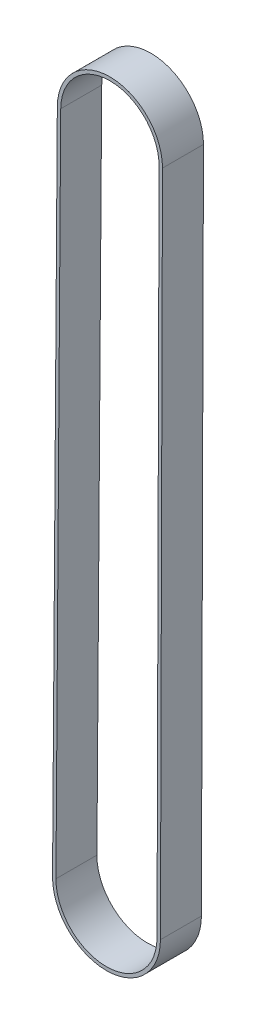
ISO-10303-21;
HEADER;
FILE_DESCRIPTION(('STEP AP214'),'2;1');
FILE_NAME('part.step','',(''),(''),'','','');
FILE_SCHEMA(('AUTOMOTIVE_DESIGN { 1 0 10303 214 1 1 1 1 }'));
ENDSEC;
DATA;
#1=APPLICATION_CONTEXT('core data for automotive mechanical design processes');
#2=APPLICATION_PROTOCOL_DEFINITION('international standard','automotive_design',2000,#1);
#3=PRODUCT_CONTEXT('',#1,'mechanical');
#4=PRODUCT('Part','Part','',(#3));
#5=PRODUCT_RELATED_PRODUCT_CATEGORY('part','',(#4));
#6=PRODUCT_DEFINITION_FORMATION('','',#4);
#7=PRODUCT_DEFINITION_CONTEXT('part definition',#1,'design');
#8=PRODUCT_DEFINITION('design','',#6,#7);
#9=PRODUCT_DEFINITION_SHAPE('','',#8);
#10=(LENGTH_UNIT() NAMED_UNIT(*) SI_UNIT(.MILLI.,.METRE.));
#11=(NAMED_UNIT(*) PLANE_ANGLE_UNIT() SI_UNIT($,.RADIAN.));
#12=(NAMED_UNIT(*) SI_UNIT($,.STERADIAN.) SOLID_ANGLE_UNIT());
#13=UNCERTAINTY_MEASURE_WITH_UNIT(LENGTH_MEASURE(1.E-05),#10,'distance_accuracy_value','');
#14=(GEOMETRIC_REPRESENTATION_CONTEXT(3) GLOBAL_UNCERTAINTY_ASSIGNED_CONTEXT((#13)) GLOBAL_UNIT_ASSIGNED_CONTEXT((#10,
#11,#12)) REPRESENTATION_CONTEXT('',''));
#15=CARTESIAN_POINT('',(0.,0.,0.));
#16=DIRECTION('',(0.,0.,1.));
#17=DIRECTION('',(1.,0.,0.));
#18=AXIS2_PLACEMENT_3D('',#15,#16,#17);
#19=CARTESIAN_POINT('',(0.,-2.79999999999996,6.25));
#20=DIRECTION('',(0.,0.,-1.));
#21=DIRECTION('',(-1.,0.,0.));
#22=AXIS2_PLACEMENT_3D('',#19,#20,#21);
#23=PLANE('',#22);
#24=CARTESIAN_POINT('',(0.,-2.79999999999996,6.25));
#25=DIRECTION('',(0.,0.,-1.));
#26=DIRECTION('',(-1.,0.,0.));
#27=AXIS2_PLACEMENT_3D('',#24,#25,#26);
#28=CIRCLE('',#27,7.7);
#29=CARTESIAN_POINT('',(7.6999639217618,-2.82357124449873,6.25));
#30=VERTEX_POINT('',#29);
#31=CARTESIAN_POINT('',(-7.69980357608143,-2.74500100216281,6.25));
#32=VERTEX_POINT('',#31);
#33=EDGE_CURVE('E158',#30,#32,#28,.F.);
#34=ORIENTED_EDGE('',*,*,#33,.T.);
#35=DIRECTION('',(-0.0071427269918372,-0.99997449040019,0.));
#36=VECTOR('',#35,1.);
#37=CARTESIAN_POINT('',(-7.69980357608143,-2.74500100216281,6.25));
#38=LINE('',#37,#36);
#39=CARTESIAN_POINT('',(-8.39979847416142,-100.743572456764,6.25));
#40=VERTEX_POINT('',#39);
#41=EDGE_CURVE('E161',#32,#40,#38,.T.);
#42=ORIENTED_EDGE('',*,*,#41,.T.);
#43=CARTESIAN_POINT('',(-0.49999999999991,-100.8,6.25));
#44=DIRECTION('',(0.,0.,-1.));
#45=DIRECTION('',(-1.,0.,0.));
#46=AXIS2_PLACEMENT_3D('',#43,#44,#45);
#47=CIRCLE('',#46,7.90000000000001);
#48=CARTESIAN_POINT('',(7.39996298466476,-100.824183484616,6.25));
#49=VERTEX_POINT('',#48);
#50=EDGE_CURVE('E164',#40,#49,#47,.F.);
#51=ORIENTED_EDGE('',*,*,#50,.T.);
#52=DIRECTION('',(0.00306120058425712,0.999995314514515,0.));
#53=VECTOR('',#52,1.);
#54=CARTESIAN_POINT('',(7.6999639217618,-2.82357124449873,6.25));
#55=LINE('',#54,#53);
#56=EDGE_CURVE('E166',#49,#30,#55,.T.);
#57=ORIENTED_EDGE('',*,*,#56,.T.);
#58=EDGE_LOOP('',(#34,#42,#51,#57));
#59=FACE_BOUND('',#58,.T.);
#60=CARTESIAN_POINT('',(0.,-2.79999999999996,6.25));
#61=DIRECTION('',(0.,0.,1.));
#62=DIRECTION('',(-1.,0.,0.));
#63=AXIS2_PLACEMENT_3D('',#60,#61,#62);
#64=CIRCLE('',#63,7.2);
#65=CARTESIAN_POINT('',(7.19996626450454,-2.82204064420661,6.25));
#66=VERTEX_POINT('',#65);
#67=CARTESIAN_POINT('',(-7.19981633088134,-2.74857236565873,6.25));
#68=VERTEX_POINT('',#67);
#69=EDGE_CURVE('E122',#66,#68,#64,.T.);
#70=ORIENTED_EDGE('',*,*,#69,.F.);
#71=DIRECTION('',(0.00306120058425712,0.999995314514515,0.));
#72=VECTOR('',#71,1.);
#73=CARTESIAN_POINT('',(7.19996626450454,-2.82204064420661,6.25));
#74=LINE('',#73,#72);
#75=CARTESIAN_POINT('',(6.8999653274075,-100.822652884323,6.25));
#76=VERTEX_POINT('',#75);
#77=EDGE_CURVE('E144',#76,#66,#74,.T.);
#78=ORIENTED_EDGE('',*,*,#77,.F.);
#79=CARTESIAN_POINT('',(-0.49999999999991,-100.8,6.25));
#80=DIRECTION('',(0.,0.,1.));
#81=DIRECTION('',(-1.,0.,0.));
#82=AXIS2_PLACEMENT_3D('',#79,#80,#81);
#83=CIRCLE('',#82,7.40000000000001);
#84=CARTESIAN_POINT('',(-7.89981122896132,-100.74714382026,6.25));
#85=VERTEX_POINT('',#84);
#86=EDGE_CURVE('E142',#85,#76,#83,.T.);
#87=ORIENTED_EDGE('',*,*,#86,.F.);
#88=DIRECTION('',(-0.0071427269918372,-0.99997449040019,0.));
#89=VECTOR('',#88,1.);
#90=CARTESIAN_POINT('',(-7.89981122896132,-100.74714382026,6.25));
#91=LINE('',#90,#89);
#92=EDGE_CURVE('E130',#68,#85,#91,.T.);
#93=ORIENTED_EDGE('',*,*,#92,.F.);
#94=EDGE_LOOP('',(#70,#78,#87,#93));
#95=FACE_BOUND('',#94,.T.);
#96=ADVANCED_FACE('F57',(#59,#95),#23,.F.);
#97=CARTESIAN_POINT('',(0.,-2.79999999999996,0.25));
#98=DIRECTION('',(0.,0.,-1.));
#99=DIRECTION('',(-1.,0.,0.));
#100=AXIS2_PLACEMENT_3D('',#97,#98,#99);
#101=PLANE('',#100);
#102=CARTESIAN_POINT('',(0.,-2.79999999999996,0.25));
#103=DIRECTION('',(0.,0.,-1.));
#104=DIRECTION('',(-1.,0.,0.));
#105=AXIS2_PLACEMENT_3D('',#102,#103,#104);
#106=CIRCLE('',#105,7.7);
#107=CARTESIAN_POINT('',(7.6999639217618,-2.82357124449873,0.25));
#108=VERTEX_POINT('',#107);
#109=CARTESIAN_POINT('',(-7.69980357608143,-2.74500100216281,0.249999999999999));
#110=VERTEX_POINT('',#109);
#111=EDGE_CURVE('E138',#108,#110,#106,.F.);
#112=ORIENTED_EDGE('',*,*,#111,.F.);
#113=DIRECTION('',(0.00306120058425712,0.999995314514515,0.));
#114=VECTOR('',#113,1.);
#115=CARTESIAN_POINT('',(7.6999639217618,-2.82357124449873,0.25));
#116=LINE('',#115,#114);
#117=CARTESIAN_POINT('',(7.39996298466476,-100.824183484616,0.25));
#118=VERTEX_POINT('',#117);
#119=EDGE_CURVE('E162',#118,#108,#116,.T.);
#120=ORIENTED_EDGE('',*,*,#119,.F.);
#121=CARTESIAN_POINT('',(-0.49999999999991,-100.8,0.25));
#122=DIRECTION('',(0.,0.,-1.));
#123=DIRECTION('',(-1.,0.,0.));
#124=AXIS2_PLACEMENT_3D('',#121,#122,#123);
#125=CIRCLE('',#124,7.90000000000001);
#126=CARTESIAN_POINT('',(-8.39979847416142,-100.743572456764,0.249999999999999));
#127=VERTEX_POINT('',#126);
#128=EDGE_CURVE('E173',#127,#118,#125,.F.);
#129=ORIENTED_EDGE('',*,*,#128,.F.);
#130=DIRECTION('',(-0.0071427269918372,-0.99997449040019,0.));
#131=VECTOR('',#130,1.);
#132=CARTESIAN_POINT('',(-7.69980357608143,-2.74500100216281,0.25));
#133=LINE('',#132,#131);
#134=EDGE_CURVE('E171',#110,#127,#133,.T.);
#135=ORIENTED_EDGE('',*,*,#134,.F.);
#136=EDGE_LOOP('',(#112,#120,#129,#135));
#137=FACE_BOUND('',#136,.T.);
#138=DIRECTION('',(0.00306120058425712,0.999995314514515,0.));
#139=VECTOR('',#138,1.);
#140=CARTESIAN_POINT('',(7.19996626450454,-2.82204064420661,0.25));
#141=LINE('',#140,#139);
#142=CARTESIAN_POINT('',(6.8999653274075,-100.822652884323,0.25));
#143=VERTEX_POINT('',#142);
#144=CARTESIAN_POINT('',(7.19996626450454,-2.82204064420661,0.25));
#145=VERTEX_POINT('',#144);
#146=EDGE_CURVE('E131',#143,#145,#141,.T.);
#147=ORIENTED_EDGE('',*,*,#146,.T.);
#148=CARTESIAN_POINT('',(0.,-2.79999999999996,0.25));
#149=DIRECTION('',(0.,0.,1.));
#150=DIRECTION('',(-1.,0.,0.));
#151=AXIS2_PLACEMENT_3D('',#148,#149,#150);
#152=CIRCLE('',#151,7.2);
#153=CARTESIAN_POINT('',(-7.19981633088134,-2.74857236565873,0.25));
#154=VERTEX_POINT('',#153);
#155=EDGE_CURVE('E80',#145,#154,#152,.T.);
#156=ORIENTED_EDGE('',*,*,#155,.T.);
#157=DIRECTION('',(-0.0071427269918372,-0.99997449040019,0.));
#158=VECTOR('',#157,1.);
#159=CARTESIAN_POINT('',(-7.89981122896132,-100.74714382026,0.25));
#160=LINE('',#159,#158);
#161=CARTESIAN_POINT('',(-7.89981122896132,-100.74714382026,0.25));
#162=VERTEX_POINT('',#161);
#163=EDGE_CURVE('E137',#154,#162,#160,.T.);
#164=ORIENTED_EDGE('',*,*,#163,.T.);
#165=CARTESIAN_POINT('',(-0.49999999999991,-100.8,0.25));
#166=DIRECTION('',(0.,0.,1.));
#167=DIRECTION('',(-1.,0.,0.));
#168=AXIS2_PLACEMENT_3D('',#165,#166,#167);
#169=CIRCLE('',#168,7.40000000000001);
#170=EDGE_CURVE('E150',#162,#143,#169,.T.);
#171=ORIENTED_EDGE('',*,*,#170,.T.);
#172=EDGE_LOOP('',(#147,#156,#164,#171));
#173=FACE_BOUND('',#172,.T.);
#174=ADVANCED_FACE('F191',(#137,#173),#101,.T.);
#175=CARTESIAN_POINT('',(0.,-2.79999999999996,6.25));
#176=DIRECTION('',(0.,0.,-1.));
#177=DIRECTION('',(-1.,0.,0.));
#178=AXIS2_PLACEMENT_3D('',#175,#176,#177);
#179=CYLINDRICAL_SURFACE('',#178,7.7);
#180=ORIENTED_EDGE('',*,*,#111,.T.);
#181=DIRECTION('',(0.,0.,-1.));
#182=VECTOR('',#181,1.);
#183=CARTESIAN_POINT('',(-7.69980357608143,-2.74500100216281,6.25));
#184=LINE('',#183,#182);
#185=EDGE_CURVE('E12',#32,#110,#184,.T.);
#186=ORIENTED_EDGE('',*,*,#185,.F.);
#187=ORIENTED_EDGE('',*,*,#33,.F.);
#188=DIRECTION('',(0.,0.,-1.));
#189=VECTOR('',#188,1.);
#190=CARTESIAN_POINT('',(7.6999639217618,-2.82357124449873,6.25));
#191=LINE('',#190,#189);
#192=EDGE_CURVE('E168',#30,#108,#191,.T.);
#193=ORIENTED_EDGE('',*,*,#192,.T.);
#194=EDGE_LOOP('',(#180,#186,#187,#193));
#195=FACE_BOUND('',#194,.T.);
#196=ADVANCED_FACE('F59',(#195),#179,.T.);
#197=CARTESIAN_POINT('',(-7.69980357608143,-2.74500100216281,6.25));
#198=DIRECTION('',(0.99997449040019,-0.0071427269918372,0.));
#199=DIRECTION('',(0.0071427269918372,0.99997449040019,0.));
#200=AXIS2_PLACEMENT_3D('',#197,#198,#199);
#201=PLANE('',#200);
#202=ORIENTED_EDGE('',*,*,#134,.T.);
#203=DIRECTION('',(0.,0.,-1.));
#204=VECTOR('',#203,1.);
#205=CARTESIAN_POINT('',(-8.39979847416142,-100.743572456764,6.25));
#206=LINE('',#205,#204);
#207=EDGE_CURVE('E65',#40,#127,#206,.T.);
#208=ORIENTED_EDGE('',*,*,#207,.F.);
#209=ORIENTED_EDGE('',*,*,#41,.F.);
#210=ORIENTED_EDGE('',*,*,#185,.T.);
#211=EDGE_LOOP('',(#202,#208,#209,#210));
#212=FACE_BOUND('',#211,.T.);
#213=ADVANCED_FACE('F201',(#212),#201,.F.);
#214=CARTESIAN_POINT('',(-0.49999999999991,-100.8,6.25));
#215=DIRECTION('',(0.,0.,-1.));
#216=DIRECTION('',(-1.,0.,0.));
#217=AXIS2_PLACEMENT_3D('',#214,#215,#216);
#218=CYLINDRICAL_SURFACE('',#217,7.90000000000001);
#219=ORIENTED_EDGE('',*,*,#128,.T.);
#220=DIRECTION('',(0.,0.,-1.));
#221=VECTOR('',#220,1.);
#222=CARTESIAN_POINT('',(7.39996298466476,-100.824183484616,6.25));
#223=LINE('',#222,#221);
#224=EDGE_CURVE('E178',#49,#118,#223,.T.);
#225=ORIENTED_EDGE('',*,*,#224,.F.);
#226=ORIENTED_EDGE('',*,*,#50,.F.);
#227=ORIENTED_EDGE('',*,*,#207,.T.);
#228=EDGE_LOOP('',(#219,#225,#226,#227));
#229=FACE_BOUND('',#228,.T.);
#230=ADVANCED_FACE('F185',(#229),#218,.T.);
#231=CARTESIAN_POINT('',(7.6999639217618,-2.82357124449873,6.25));
#232=DIRECTION('',(-0.999995314514515,0.00306120058425712,0.));
#233=DIRECTION('',(-0.00306120058425712,-0.999995314514515,0.));
#234=AXIS2_PLACEMENT_3D('',#231,#232,#233);
#235=PLANE('',#234);
#236=ORIENTED_EDGE('',*,*,#119,.T.);
#237=ORIENTED_EDGE('',*,*,#192,.F.);
#238=ORIENTED_EDGE('',*,*,#56,.F.);
#239=ORIENTED_EDGE('',*,*,#224,.T.);
#240=EDGE_LOOP('',(#236,#237,#238,#239));
#241=FACE_BOUND('',#240,.T.);
#242=ADVANCED_FACE('F195',(#241),#235,.F.);
#243=CARTESIAN_POINT('',(0.,-2.79999999999996,6.25));
#244=DIRECTION('',(0.,0.,-1.));
#245=DIRECTION('',(-1.,0.,0.));
#246=AXIS2_PLACEMENT_3D('',#243,#244,#245);
#247=CYLINDRICAL_SURFACE('',#246,7.2);
#248=ORIENTED_EDGE('',*,*,#155,.F.);
#249=DIRECTION('',(0.,0.,-1.));
#250=VECTOR('',#249,1.);
#251=CARTESIAN_POINT('',(7.19996626450454,-2.82204064420661,6.25));
#252=LINE('',#251,#250);
#253=EDGE_CURVE('E126',#66,#145,#252,.T.);
#254=ORIENTED_EDGE('',*,*,#253,.F.);
#255=ORIENTED_EDGE('',*,*,#69,.T.);
#256=DIRECTION('',(0.,0.,-1.));
#257=VECTOR('',#256,1.);
#258=CARTESIAN_POINT('',(-7.19981633088134,-2.74857236565873,6.25));
#259=LINE('',#258,#257);
#260=EDGE_CURVE('E125',#68,#154,#259,.T.);
#261=ORIENTED_EDGE('',*,*,#260,.T.);
#262=EDGE_LOOP('',(#248,#254,#255,#261));
#263=FACE_BOUND('',#262,.T.);
#264=ADVANCED_FACE('F124',(#263),#247,.F.);
#265=CARTESIAN_POINT('',(-7.89981122896132,-100.74714382026,6.25));
#266=DIRECTION('',(0.99997449040019,-0.0071427269918372,0.));
#267=DIRECTION('',(0.0071427269918372,0.99997449040019,0.));
#268=AXIS2_PLACEMENT_3D('',#265,#266,#267);
#269=PLANE('',#268);
#270=ORIENTED_EDGE('',*,*,#163,.F.);
#271=ORIENTED_EDGE('',*,*,#260,.F.);
#272=ORIENTED_EDGE('',*,*,#92,.T.);
#273=DIRECTION('',(0.,0.,-1.));
#274=VECTOR('',#273,1.);
#275=CARTESIAN_POINT('',(-7.89981122896132,-100.74714382026,6.25));
#276=LINE('',#275,#274);
#277=EDGE_CURVE('E139',#85,#162,#276,.T.);
#278=ORIENTED_EDGE('',*,*,#277,.T.);
#279=EDGE_LOOP('',(#270,#271,#272,#278));
#280=FACE_BOUND('',#279,.T.);
#281=ADVANCED_FACE('F134',(#280),#269,.T.);
#282=CARTESIAN_POINT('',(-0.49999999999991,-100.8,6.25));
#283=DIRECTION('',(0.,0.,-1.));
#284=DIRECTION('',(-1.,0.,0.));
#285=AXIS2_PLACEMENT_3D('',#282,#283,#284);
#286=CYLINDRICAL_SURFACE('',#285,7.40000000000001);
#287=ORIENTED_EDGE('',*,*,#170,.F.);
#288=ORIENTED_EDGE('',*,*,#277,.F.);
#289=ORIENTED_EDGE('',*,*,#86,.T.);
#290=DIRECTION('',(0.,0.,-1.));
#291=VECTOR('',#290,1.);
#292=CARTESIAN_POINT('',(6.8999653274075,-100.822652884323,6.25));
#293=LINE('',#292,#291);
#294=EDGE_CURVE('E72',#76,#143,#293,.T.);
#295=ORIENTED_EDGE('',*,*,#294,.T.);
#296=EDGE_LOOP('',(#287,#288,#289,#295));
#297=FACE_BOUND('',#296,.T.);
#298=ADVANCED_FACE('F224',(#297),#286,.F.);
#299=CARTESIAN_POINT('',(7.19996626450454,-2.82204064420661,6.25));
#300=DIRECTION('',(-0.999995314514515,0.00306120058425712,0.));
#301=DIRECTION('',(-0.00306120058425712,-0.999995314514515,0.));
#302=AXIS2_PLACEMENT_3D('',#299,#300,#301);
#303=PLANE('',#302);
#304=ORIENTED_EDGE('',*,*,#146,.F.);
#305=ORIENTED_EDGE('',*,*,#294,.F.);
#306=ORIENTED_EDGE('',*,*,#77,.T.);
#307=ORIENTED_EDGE('',*,*,#253,.T.);
#308=EDGE_LOOP('',(#304,#305,#306,#307));
#309=FACE_BOUND('',#308,.T.);
#310=ADVANCED_FACE('F228',(#309),#303,.T.);
#311=CLOSED_SHELL('',(#96,#174,#196,#213,#230,#242,#264,#281,#298,#310));
#312=MANIFOLD_SOLID_BREP('B2',#311);
#313=ADVANCED_BREP_SHAPE_REPRESENTATION('',(#18,#312),#14);
#314=SHAPE_DEFINITION_REPRESENTATION(#9,#313);
ENDSEC;
END-ISO-10303-21;
